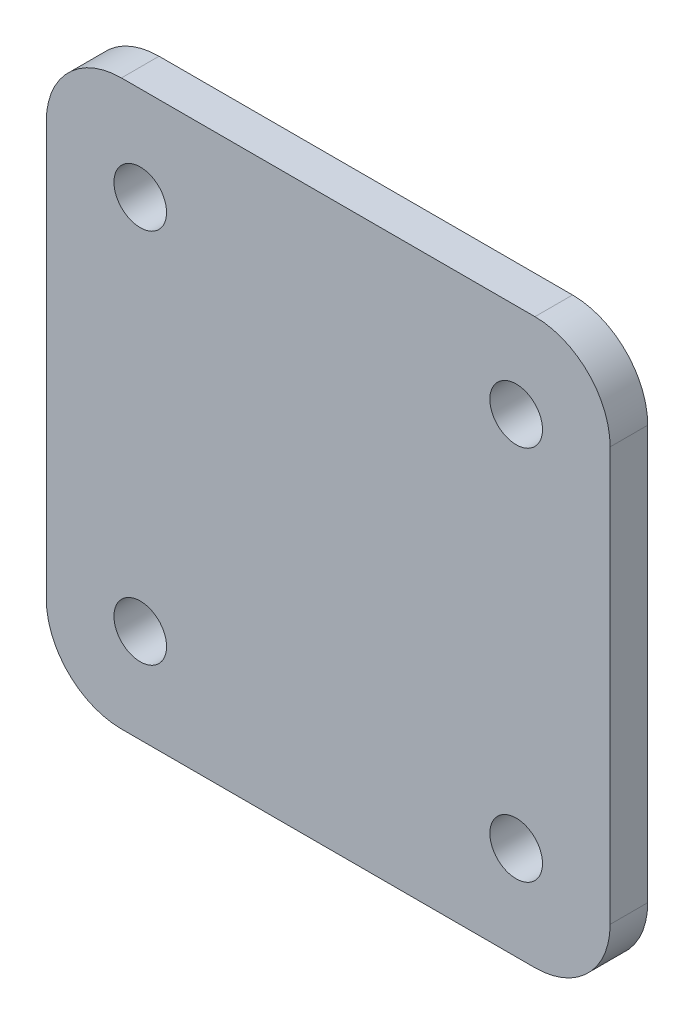
ISO-10303-21;
HEADER;
FILE_DESCRIPTION(('STEP AP214'),'2;1');
FILE_NAME('part.step','',(''),(''),'','','');
FILE_SCHEMA(('AUTOMOTIVE_DESIGN { 1 0 10303 214 1 1 1 1 }'));
ENDSEC;
DATA;
#1=APPLICATION_CONTEXT('core data for automotive mechanical design processes');
#2=APPLICATION_PROTOCOL_DEFINITION('international standard','automotive_design',2000,#1);
#3=PRODUCT_CONTEXT('',#1,'mechanical');
#4=PRODUCT('Part','Part','',(#3));
#5=PRODUCT_RELATED_PRODUCT_CATEGORY('part','',(#4));
#6=PRODUCT_DEFINITION_FORMATION('','',#4);
#7=PRODUCT_DEFINITION_CONTEXT('part definition',#1,'design');
#8=PRODUCT_DEFINITION('design','',#6,#7);
#9=PRODUCT_DEFINITION_SHAPE('','',#8);
#10=(LENGTH_UNIT() NAMED_UNIT(*) SI_UNIT(.MILLI.,.METRE.));
#11=(NAMED_UNIT(*) PLANE_ANGLE_UNIT() SI_UNIT($,.RADIAN.));
#12=(NAMED_UNIT(*) SI_UNIT($,.STERADIAN.) SOLID_ANGLE_UNIT());
#13=UNCERTAINTY_MEASURE_WITH_UNIT(LENGTH_MEASURE(1.E-05),#10,'distance_accuracy_value','');
#14=(GEOMETRIC_REPRESENTATION_CONTEXT(3) GLOBAL_UNCERTAINTY_ASSIGNED_CONTEXT((#13)) GLOBAL_UNIT_ASSIGNED_CONTEXT((#10,
#11,#12)) REPRESENTATION_CONTEXT('',''));
#15=CARTESIAN_POINT('',(0.,0.,0.));
#16=DIRECTION('',(0.,0.,1.));
#17=DIRECTION('',(1.,0.,0.));
#18=AXIS2_PLACEMENT_3D('',#15,#16,#17);
#19=CARTESIAN_POINT('',(-37.5,37.5,5.));
#20=DIRECTION('',(1.,0.,0.));
#21=DIRECTION('',(0.,1.,0.));
#22=AXIS2_PLACEMENT_3D('',#19,#20,#21);
#23=PLANE('',#22);
#24=DIRECTION('',(0.,-1.,0.));
#25=VECTOR('',#24,1.);
#26=CARTESIAN_POINT('',(-37.5,37.5,5.));
#27=LINE('',#26,#25);
#28=CARTESIAN_POINT('',(-37.5,27.5,5.));
#29=VERTEX_POINT('',#28);
#30=CARTESIAN_POINT('',(-37.5,-27.5,5.));
#31=VERTEX_POINT('',#30);
#32=EDGE_CURVE('E117',#29,#31,#27,.T.);
#33=ORIENTED_EDGE('',*,*,#32,.F.);
#34=DIRECTION('',(0.,0.,-1.));
#35=VECTOR('',#34,1.);
#36=CARTESIAN_POINT('',(-37.5,27.5,5.));
#37=LINE('',#36,#35);
#38=CARTESIAN_POINT('',(-37.5,27.5,0.));
#39=VERTEX_POINT('',#38);
#40=EDGE_CURVE('E102',#29,#39,#37,.T.);
#41=ORIENTED_EDGE('',*,*,#40,.T.);
#42=DIRECTION('',(0.,-1.,0.));
#43=VECTOR('',#42,1.);
#44=CARTESIAN_POINT('',(-37.5,37.5,0.));
#45=LINE('',#44,#43);
#46=CARTESIAN_POINT('',(-37.5,-27.5,0.));
#47=VERTEX_POINT('',#46);
#48=EDGE_CURVE('E114',#39,#47,#45,.T.);
#49=ORIENTED_EDGE('',*,*,#48,.T.);
#50=DIRECTION('',(0.,0.,-1.));
#51=VECTOR('',#50,1.);
#52=CARTESIAN_POINT('',(-37.5,-27.5,5.));
#53=LINE('',#52,#51);
#54=EDGE_CURVE('E119',#47,#31,#53,.F.);
#55=ORIENTED_EDGE('',*,*,#54,.T.);
#56=EDGE_LOOP('',(#33,#41,#49,#55));
#57=FACE_BOUND('',#56,.T.);
#58=ADVANCED_FACE('F32',(#57),#23,.F.);
#59=CARTESIAN_POINT('',(-37.5,-37.5,5.));
#60=DIRECTION('',(0.,1.,0.));
#61=DIRECTION('',(-1.,0.,0.));
#62=AXIS2_PLACEMENT_3D('',#59,#60,#61);
#63=PLANE('',#62);
#64=DIRECTION('',(1.,0.,0.));
#65=VECTOR('',#64,1.);
#66=CARTESIAN_POINT('',(-37.5,-37.5,5.));
#67=LINE('',#66,#65);
#68=CARTESIAN_POINT('',(-27.5,-37.5,5.));
#69=VERTEX_POINT('',#68);
#70=CARTESIAN_POINT('',(27.5,-37.5,5.));
#71=VERTEX_POINT('',#70);
#72=EDGE_CURVE('E163',#69,#71,#67,.T.);
#73=ORIENTED_EDGE('',*,*,#72,.F.);
#74=DIRECTION('',(0.,0.,-1.));
#75=VECTOR('',#74,1.);
#76=CARTESIAN_POINT('',(-27.5,-37.5,5.));
#77=LINE('',#76,#75);
#78=CARTESIAN_POINT('',(-27.5,-37.5,0.));
#79=VERTEX_POINT('',#78);
#80=EDGE_CURVE('E156',#69,#79,#77,.T.);
#81=ORIENTED_EDGE('',*,*,#80,.T.);
#82=DIRECTION('',(1.,0.,0.));
#83=VECTOR('',#82,1.);
#84=CARTESIAN_POINT('',(-37.5,-37.5,0.));
#85=LINE('',#84,#83);
#86=CARTESIAN_POINT('',(27.5,-37.5,0.));
#87=VERTEX_POINT('',#86);
#88=EDGE_CURVE('E123',#79,#87,#85,.T.);
#89=ORIENTED_EDGE('',*,*,#88,.T.);
#90=DIRECTION('',(0.,0.,-1.));
#91=VECTOR('',#90,1.);
#92=CARTESIAN_POINT('',(27.5,-37.5,5.));
#93=LINE('',#92,#91);
#94=EDGE_CURVE('E154',#87,#71,#93,.F.);
#95=ORIENTED_EDGE('',*,*,#94,.T.);
#96=EDGE_LOOP('',(#73,#81,#89,#95));
#97=FACE_BOUND('',#96,.T.);
#98=ADVANCED_FACE('F161',(#97),#63,.F.);
#99=CARTESIAN_POINT('',(37.5,37.5,5.));
#100=DIRECTION('',(-1.,0.,0.));
#101=DIRECTION('',(0.,0.,1.));
#102=AXIS2_PLACEMENT_3D('',#99,#100,#101);
#103=PLANE('',#102);
#104=DIRECTION('',(0.,1.,0.));
#105=VECTOR('',#104,1.);
#106=CARTESIAN_POINT('',(37.5,37.5,5.));
#107=LINE('',#106,#105);
#108=CARTESIAN_POINT('',(37.5,-27.5,5.));
#109=VERTEX_POINT('',#108);
#110=CARTESIAN_POINT('',(37.5,27.5,5.));
#111=VERTEX_POINT('',#110);
#112=EDGE_CURVE('E171',#109,#111,#107,.T.);
#113=ORIENTED_EDGE('',*,*,#112,.F.);
#114=DIRECTION('',(0.,0.,-1.));
#115=VECTOR('',#114,1.);
#116=CARTESIAN_POINT('',(37.5,-27.5,5.));
#117=LINE('',#116,#115);
#118=CARTESIAN_POINT('',(37.5,-27.5,0.));
#119=VERTEX_POINT('',#118);
#120=EDGE_CURVE('E11',#109,#119,#117,.T.);
#121=ORIENTED_EDGE('',*,*,#120,.T.);
#122=DIRECTION('',(0.,1.,0.));
#123=VECTOR('',#122,1.);
#124=CARTESIAN_POINT('',(37.5,37.5,0.));
#125=LINE('',#124,#123);
#126=CARTESIAN_POINT('',(37.5,27.5,0.));
#127=VERTEX_POINT('',#126);
#128=EDGE_CURVE('E127',#119,#127,#125,.T.);
#129=ORIENTED_EDGE('',*,*,#128,.T.);
#130=DIRECTION('',(0.,0.,-1.));
#131=VECTOR('',#130,1.);
#132=CARTESIAN_POINT('',(37.5,27.5,5.));
#133=LINE('',#132,#131);
#134=EDGE_CURVE('E40',#127,#111,#133,.F.);
#135=ORIENTED_EDGE('',*,*,#134,.T.);
#136=EDGE_LOOP('',(#113,#121,#129,#135));
#137=FACE_BOUND('',#136,.T.);
#138=ADVANCED_FACE('F170',(#137),#103,.F.);
#139=CARTESIAN_POINT('',(-37.5,37.5,5.));
#140=DIRECTION('',(0.,-1.,0.));
#141=DIRECTION('',(1.,0.,0.));
#142=AXIS2_PLACEMENT_3D('',#139,#140,#141);
#143=PLANE('',#142);
#144=DIRECTION('',(-1.,0.,0.));
#145=VECTOR('',#144,1.);
#146=CARTESIAN_POINT('',(-37.5,37.5,0.));
#147=LINE('',#146,#145);
#148=CARTESIAN_POINT('',(27.5,37.5,0.));
#149=VERTEX_POINT('',#148);
#150=CARTESIAN_POINT('',(-27.5,37.5,0.));
#151=VERTEX_POINT('',#150);
#152=EDGE_CURVE('E137',#149,#151,#147,.T.);
#153=ORIENTED_EDGE('',*,*,#152,.T.);
#154=DIRECTION('',(0.,0.,-1.));
#155=VECTOR('',#154,1.);
#156=CARTESIAN_POINT('',(-27.5,37.5,5.));
#157=LINE('',#156,#155);
#158=CARTESIAN_POINT('',(-27.5,37.5,5.));
#159=VERTEX_POINT('',#158);
#160=EDGE_CURVE('E103',#151,#159,#157,.F.);
#161=ORIENTED_EDGE('',*,*,#160,.T.);
#162=DIRECTION('',(-1.,0.,0.));
#163=VECTOR('',#162,1.);
#164=CARTESIAN_POINT('',(-37.5,37.5,5.));
#165=LINE('',#164,#163);
#166=CARTESIAN_POINT('',(27.5,37.5,5.));
#167=VERTEX_POINT('',#166);
#168=EDGE_CURVE('E133',#167,#159,#165,.T.);
#169=ORIENTED_EDGE('',*,*,#168,.F.);
#170=DIRECTION('',(0.,0.,-1.));
#171=VECTOR('',#170,1.);
#172=CARTESIAN_POINT('',(27.5,37.5,5.));
#173=LINE('',#172,#171);
#174=EDGE_CURVE('E108',#167,#149,#173,.T.);
#175=ORIENTED_EDGE('',*,*,#174,.T.);
#176=EDGE_LOOP('',(#153,#161,#169,#175));
#177=FACE_BOUND('',#176,.T.);
#178=ADVANCED_FACE('F203',(#177),#143,.F.);
#179=CARTESIAN_POINT('',(0.,0.,5.));
#180=DIRECTION('',(0.,0.,1.));
#181=DIRECTION('',(1.,0.,0.));
#182=AXIS2_PLACEMENT_3D('',#179,#180,#181);
#183=PLANE('',#182);
#184=CARTESIAN_POINT('',(-25.,25.,5.));
#185=DIRECTION('',(0.,0.,1.));
#186=DIRECTION('',(1.,0.,0.));
#187=AXIS2_PLACEMENT_3D('',#184,#185,#186);
#188=CIRCLE('',#187,3.5);
#189=CARTESIAN_POINT('',(-21.5,25.,5.));
#190=VERTEX_POINT('',#189);
#191=EDGE_CURVE('E194',#190,#190,#188,.T.);
#192=ORIENTED_EDGE('',*,*,#191,.F.);
#193=EDGE_LOOP('',(#192));
#194=FACE_BOUND('',#193,.T.);
#195=CARTESIAN_POINT('',(-25.,-25.,5.));
#196=DIRECTION('',(0.,0.,1.));
#197=DIRECTION('',(1.,0.,0.));
#198=AXIS2_PLACEMENT_3D('',#195,#196,#197);
#199=CIRCLE('',#198,3.5);
#200=CARTESIAN_POINT('',(-21.5,-25.,5.));
#201=VERTEX_POINT('',#200);
#202=EDGE_CURVE('E188',#201,#201,#199,.T.);
#203=ORIENTED_EDGE('',*,*,#202,.F.);
#204=EDGE_LOOP('',(#203));
#205=FACE_BOUND('',#204,.T.);
#206=CARTESIAN_POINT('',(25.,-25.,5.));
#207=DIRECTION('',(0.,0.,1.));
#208=DIRECTION('',(1.,0.,0.));
#209=AXIS2_PLACEMENT_3D('',#206,#207,#208);
#210=CIRCLE('',#209,3.5);
#211=CARTESIAN_POINT('',(28.5,-25.,5.));
#212=VERTEX_POINT('',#211);
#213=EDGE_CURVE('E182',#212,#212,#210,.T.);
#214=ORIENTED_EDGE('',*,*,#213,.F.);
#215=EDGE_LOOP('',(#214));
#216=FACE_BOUND('',#215,.T.);
#217=CARTESIAN_POINT('',(25.,25.,5.));
#218=DIRECTION('',(0.,0.,1.));
#219=DIRECTION('',(1.,0.,0.));
#220=AXIS2_PLACEMENT_3D('',#217,#218,#219);
#221=CIRCLE('',#220,3.5);
#222=CARTESIAN_POINT('',(28.5,25.,5.));
#223=VERTEX_POINT('',#222);
#224=EDGE_CURVE('E130',#223,#223,#221,.T.);
#225=ORIENTED_EDGE('',*,*,#224,.F.);
#226=EDGE_LOOP('',(#225));
#227=FACE_BOUND('',#226,.T.);
#228=ORIENTED_EDGE('',*,*,#168,.T.);
#229=CARTESIAN_POINT('',(-27.5,27.5,5.));
#230=DIRECTION('',(0.,0.,1.));
#231=DIRECTION('',(1.,0.,0.));
#232=AXIS2_PLACEMENT_3D('',#229,#230,#231);
#233=CIRCLE('',#232,10.);
#234=EDGE_CURVE('E152',#159,#29,#233,.T.);
#235=ORIENTED_EDGE('',*,*,#234,.T.);
#236=ORIENTED_EDGE('',*,*,#32,.T.);
#237=CARTESIAN_POINT('',(-27.5,-27.5,5.));
#238=DIRECTION('',(0.,0.,1.));
#239=DIRECTION('',(1.,0.,0.));
#240=AXIS2_PLACEMENT_3D('',#237,#238,#239);
#241=CIRCLE('',#240,10.);
#242=EDGE_CURVE('E150',#31,#69,#241,.T.);
#243=ORIENTED_EDGE('',*,*,#242,.T.);
#244=ORIENTED_EDGE('',*,*,#72,.T.);
#245=CARTESIAN_POINT('',(27.5,-27.5,5.));
#246=DIRECTION('',(0.,0.,1.));
#247=DIRECTION('',(1.,0.,0.));
#248=AXIS2_PLACEMENT_3D('',#245,#246,#247);
#249=CIRCLE('',#248,10.);
#250=EDGE_CURVE('E53',#71,#109,#249,.T.);
#251=ORIENTED_EDGE('',*,*,#250,.T.);
#252=ORIENTED_EDGE('',*,*,#112,.T.);
#253=CARTESIAN_POINT('',(27.5,27.5,5.));
#254=DIRECTION('',(0.,0.,1.));
#255=DIRECTION('',(1.,0.,0.));
#256=AXIS2_PLACEMENT_3D('',#253,#254,#255);
#257=CIRCLE('',#256,10.);
#258=EDGE_CURVE('E147',#111,#167,#257,.T.);
#259=ORIENTED_EDGE('',*,*,#258,.T.);
#260=EDGE_LOOP('',(#228,#235,#236,#243,#244,#251,#252,#259));
#261=FACE_BOUND('',#260,.T.);
#262=ADVANCED_FACE('F200',(#194,#205,#216,#227,#261),#183,.T.);
#263=CARTESIAN_POINT('',(0.,0.,0.));
#264=DIRECTION('',(0.,0.,1.));
#265=DIRECTION('',(1.,0.,0.));
#266=AXIS2_PLACEMENT_3D('',#263,#264,#265);
#267=PLANE('',#266);
#268=CARTESIAN_POINT('',(-25.,25.,0.));
#269=DIRECTION('',(0.,0.,1.));
#270=DIRECTION('',(1.,0.,0.));
#271=AXIS2_PLACEMENT_3D('',#268,#269,#270);
#272=CIRCLE('',#271,3.5);
#273=CARTESIAN_POINT('',(-21.5,25.,0.));
#274=VERTEX_POINT('',#273);
#275=EDGE_CURVE('E191',#274,#274,#272,.T.);
#276=ORIENTED_EDGE('',*,*,#275,.T.);
#277=EDGE_LOOP('',(#276));
#278=FACE_BOUND('',#277,.T.);
#279=CARTESIAN_POINT('',(-25.,-25.,0.));
#280=DIRECTION('',(0.,0.,1.));
#281=DIRECTION('',(1.,0.,0.));
#282=AXIS2_PLACEMENT_3D('',#279,#280,#281);
#283=CIRCLE('',#282,3.5);
#284=CARTESIAN_POINT('',(-21.5,-25.,0.));
#285=VERTEX_POINT('',#284);
#286=EDGE_CURVE('E185',#285,#285,#283,.T.);
#287=ORIENTED_EDGE('',*,*,#286,.T.);
#288=EDGE_LOOP('',(#287));
#289=FACE_BOUND('',#288,.T.);
#290=CARTESIAN_POINT('',(25.,-25.,0.));
#291=DIRECTION('',(0.,0.,1.));
#292=DIRECTION('',(1.,0.,0.));
#293=AXIS2_PLACEMENT_3D('',#290,#291,#292);
#294=CIRCLE('',#293,3.5);
#295=CARTESIAN_POINT('',(28.5,-25.,0.));
#296=VERTEX_POINT('',#295);
#297=EDGE_CURVE('E179',#296,#296,#294,.T.);
#298=ORIENTED_EDGE('',*,*,#297,.T.);
#299=EDGE_LOOP('',(#298));
#300=FACE_BOUND('',#299,.T.);
#301=CARTESIAN_POINT('',(25.,25.,0.));
#302=DIRECTION('',(0.,0.,1.));
#303=DIRECTION('',(1.,0.,0.));
#304=AXIS2_PLACEMENT_3D('',#301,#302,#303);
#305=CIRCLE('',#304,3.5);
#306=CARTESIAN_POINT('',(28.5,25.,0.));
#307=VERTEX_POINT('',#306);
#308=EDGE_CURVE('E124',#307,#307,#305,.T.);
#309=ORIENTED_EDGE('',*,*,#308,.T.);
#310=EDGE_LOOP('',(#309));
#311=FACE_BOUND('',#310,.T.);
#312=ORIENTED_EDGE('',*,*,#48,.F.);
#313=CARTESIAN_POINT('',(-27.5,27.5,0.));
#314=DIRECTION('',(0.,0.,1.));
#315=DIRECTION('',(1.,0.,0.));
#316=AXIS2_PLACEMENT_3D('',#313,#314,#315);
#317=CIRCLE('',#316,10.);
#318=EDGE_CURVE('E98',#39,#151,#317,.F.);
#319=ORIENTED_EDGE('',*,*,#318,.T.);
#320=ORIENTED_EDGE('',*,*,#152,.F.);
#321=CARTESIAN_POINT('',(27.5,27.5,0.));
#322=DIRECTION('',(0.,0.,1.));
#323=DIRECTION('',(1.,0.,0.));
#324=AXIS2_PLACEMENT_3D('',#321,#322,#323);
#325=CIRCLE('',#324,10.);
#326=EDGE_CURVE('E118',#149,#127,#325,.F.);
#327=ORIENTED_EDGE('',*,*,#326,.T.);
#328=ORIENTED_EDGE('',*,*,#128,.F.);
#329=CARTESIAN_POINT('',(27.5,-27.5,0.));
#330=DIRECTION('',(0.,0.,1.));
#331=DIRECTION('',(1.,0.,0.));
#332=AXIS2_PLACEMENT_3D('',#329,#330,#331);
#333=CIRCLE('',#332,10.);
#334=EDGE_CURVE('E141',#119,#87,#333,.F.);
#335=ORIENTED_EDGE('',*,*,#334,.T.);
#336=ORIENTED_EDGE('',*,*,#88,.F.);
#337=CARTESIAN_POINT('',(-27.5,-27.5,0.));
#338=DIRECTION('',(0.,0.,1.));
#339=DIRECTION('',(1.,0.,0.));
#340=AXIS2_PLACEMENT_3D('',#337,#338,#339);
#341=CIRCLE('',#340,10.);
#342=EDGE_CURVE('E109',#79,#47,#341,.F.);
#343=ORIENTED_EDGE('',*,*,#342,.T.);
#344=EDGE_LOOP('',(#312,#319,#320,#327,#328,#335,#336,#343));
#345=FACE_BOUND('',#344,.T.);
#346=ADVANCED_FACE('F121',(#278,#289,#300,#311,#345),#267,.F.);
#347=CARTESIAN_POINT('',(25.,25.,5.));
#348=DIRECTION('',(0.,0.,1.));
#349=DIRECTION('',(1.,0.,0.));
#350=AXIS2_PLACEMENT_3D('',#347,#348,#349);
#351=CYLINDRICAL_SURFACE('',#350,3.5);
#352=ORIENTED_EDGE('',*,*,#308,.F.);
#353=EDGE_LOOP('',(#352));
#354=FACE_BOUND('',#353,.T.);
#355=ORIENTED_EDGE('',*,*,#224,.T.);
#356=EDGE_LOOP('',(#355));
#357=FACE_BOUND('',#356,.T.);
#358=ADVANCED_FACE('F277',(#354,#357),#351,.F.);
#359=CARTESIAN_POINT('',(25.,-25.,5.));
#360=DIRECTION('',(0.,0.,1.));
#361=DIRECTION('',(1.,0.,0.));
#362=AXIS2_PLACEMENT_3D('',#359,#360,#361);
#363=CYLINDRICAL_SURFACE('',#362,3.5);
#364=ORIENTED_EDGE('',*,*,#297,.F.);
#365=EDGE_LOOP('',(#364));
#366=FACE_BOUND('',#365,.T.);
#367=ORIENTED_EDGE('',*,*,#213,.T.);
#368=EDGE_LOOP('',(#367));
#369=FACE_BOUND('',#368,.T.);
#370=ADVANCED_FACE('F268',(#366,#369),#363,.F.);
#371=CARTESIAN_POINT('',(-25.,-25.,5.));
#372=DIRECTION('',(0.,0.,1.));
#373=DIRECTION('',(1.,0.,0.));
#374=AXIS2_PLACEMENT_3D('',#371,#372,#373);
#375=CYLINDRICAL_SURFACE('',#374,3.5);
#376=ORIENTED_EDGE('',*,*,#286,.F.);
#377=EDGE_LOOP('',(#376));
#378=FACE_BOUND('',#377,.T.);
#379=ORIENTED_EDGE('',*,*,#202,.T.);
#380=EDGE_LOOP('',(#379));
#381=FACE_BOUND('',#380,.T.);
#382=ADVANCED_FACE('F259',(#378,#381),#375,.F.);
#383=CARTESIAN_POINT('',(-25.,25.,5.));
#384=DIRECTION('',(0.,0.,1.));
#385=DIRECTION('',(1.,0.,0.));
#386=AXIS2_PLACEMENT_3D('',#383,#384,#385);
#387=CYLINDRICAL_SURFACE('',#386,3.5);
#388=ORIENTED_EDGE('',*,*,#275,.F.);
#389=EDGE_LOOP('',(#388));
#390=FACE_BOUND('',#389,.T.);
#391=ORIENTED_EDGE('',*,*,#191,.T.);
#392=EDGE_LOOP('',(#391));
#393=FACE_BOUND('',#392,.T.);
#394=ADVANCED_FACE('F198',(#390,#393),#387,.F.);
#395=CARTESIAN_POINT('',(-27.5,27.5,5.));
#396=DIRECTION('',(0.,0.,-1.));
#397=DIRECTION('',(-1.,0.,0.));
#398=AXIS2_PLACEMENT_3D('',#395,#396,#397);
#399=CYLINDRICAL_SURFACE('',#398,10.);
#400=ORIENTED_EDGE('',*,*,#234,.F.);
#401=ORIENTED_EDGE('',*,*,#160,.F.);
#402=ORIENTED_EDGE('',*,*,#318,.F.);
#403=ORIENTED_EDGE('',*,*,#40,.F.);
#404=EDGE_LOOP('',(#400,#401,#402,#403));
#405=FACE_BOUND('',#404,.T.);
#406=ADVANCED_FACE('F101',(#405),#399,.T.);
#407=CARTESIAN_POINT('',(-27.5,-27.5,5.));
#408=DIRECTION('',(0.,0.,-1.));
#409=DIRECTION('',(-1.,0.,0.));
#410=AXIS2_PLACEMENT_3D('',#407,#408,#409);
#411=CYLINDRICAL_SURFACE('',#410,10.);
#412=ORIENTED_EDGE('',*,*,#242,.F.);
#413=ORIENTED_EDGE('',*,*,#54,.F.);
#414=ORIENTED_EDGE('',*,*,#342,.F.);
#415=ORIENTED_EDGE('',*,*,#80,.F.);
#416=EDGE_LOOP('',(#412,#413,#414,#415));
#417=FACE_BOUND('',#416,.T.);
#418=ADVANCED_FACE('F218',(#417),#411,.T.);
#419=CARTESIAN_POINT('',(27.5,-27.5,5.));
#420=DIRECTION('',(0.,0.,-1.));
#421=DIRECTION('',(-1.,0.,0.));
#422=AXIS2_PLACEMENT_3D('',#419,#420,#421);
#423=CYLINDRICAL_SURFACE('',#422,10.);
#424=ORIENTED_EDGE('',*,*,#250,.F.);
#425=ORIENTED_EDGE('',*,*,#94,.F.);
#426=ORIENTED_EDGE('',*,*,#334,.F.);
#427=ORIENTED_EDGE('',*,*,#120,.F.);
#428=EDGE_LOOP('',(#424,#425,#426,#427));
#429=FACE_BOUND('',#428,.T.);
#430=ADVANCED_FACE('F169',(#429),#423,.T.);
#431=CARTESIAN_POINT('',(27.5,27.5,5.));
#432=DIRECTION('',(0.,0.,-1.));
#433=DIRECTION('',(-1.,0.,0.));
#434=AXIS2_PLACEMENT_3D('',#431,#432,#433);
#435=CYLINDRICAL_SURFACE('',#434,10.);
#436=ORIENTED_EDGE('',*,*,#258,.F.);
#437=ORIENTED_EDGE('',*,*,#134,.F.);
#438=ORIENTED_EDGE('',*,*,#326,.F.);
#439=ORIENTED_EDGE('',*,*,#174,.F.);
#440=EDGE_LOOP('',(#436,#437,#438,#439));
#441=FACE_BOUND('',#440,.T.);
#442=ADVANCED_FACE('F34',(#441),#435,.T.);
#443=CLOSED_SHELL('',(#58,#98,#138,#178,#262,#346,#358,#370,#382,#394,#406,#418,#430,#442));
#444=MANIFOLD_SOLID_BREP('B2',#443);
#445=ADVANCED_BREP_SHAPE_REPRESENTATION('',(#18,#444),#14);
#446=SHAPE_DEFINITION_REPRESENTATION(#9,#445);
ENDSEC;
END-ISO-10303-21;
